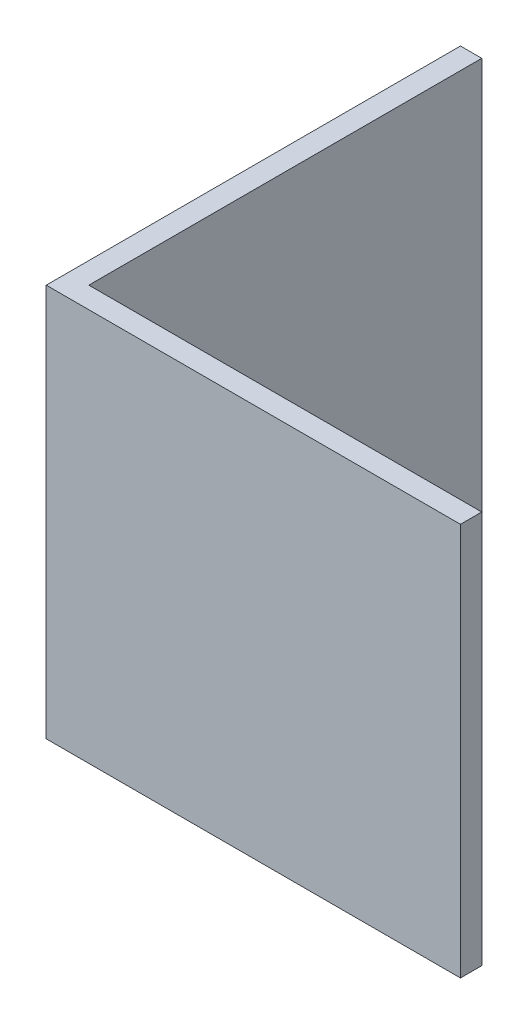
ISO-10303-21;
HEADER;
FILE_DESCRIPTION(('STEP AP214'),'2;1');
FILE_NAME('part.step','',(''),(''),'','','');
FILE_SCHEMA(('AUTOMOTIVE_DESIGN { 1 0 10303 214 1 1 1 1 }'));
ENDSEC;
DATA;
#1=APPLICATION_CONTEXT('core data for automotive mechanical design processes');
#2=APPLICATION_PROTOCOL_DEFINITION('international standard','automotive_design',2000,#1);
#3=PRODUCT_CONTEXT('',#1,'mechanical');
#4=PRODUCT('Part','Part','',(#3));
#5=PRODUCT_RELATED_PRODUCT_CATEGORY('part','',(#4));
#6=PRODUCT_DEFINITION_FORMATION('','',#4);
#7=PRODUCT_DEFINITION_CONTEXT('part definition',#1,'design');
#8=PRODUCT_DEFINITION('design','',#6,#7);
#9=PRODUCT_DEFINITION_SHAPE('','',#8);
#10=(LENGTH_UNIT() NAMED_UNIT(*) SI_UNIT(.MILLI.,.METRE.));
#11=(NAMED_UNIT(*) PLANE_ANGLE_UNIT() SI_UNIT($,.RADIAN.));
#12=(NAMED_UNIT(*) SI_UNIT($,.STERADIAN.) SOLID_ANGLE_UNIT());
#13=UNCERTAINTY_MEASURE_WITH_UNIT(LENGTH_MEASURE(1.E-05),#10,'distance_accuracy_value','');
#14=(GEOMETRIC_REPRESENTATION_CONTEXT(3) GLOBAL_UNCERTAINTY_ASSIGNED_CONTEXT((#13)) GLOBAL_UNIT_ASSIGNED_CONTEXT((#10,
#11,#12)) REPRESENTATION_CONTEXT('',''));
#15=CARTESIAN_POINT('',(0.,0.,0.));
#16=DIRECTION('',(0.,0.,1.));
#17=DIRECTION('',(1.,0.,0.));
#18=AXIS2_PLACEMENT_3D('',#15,#16,#17);
#19=CARTESIAN_POINT('',(-26.77668,50.8,26.77668));
#20=DIRECTION('',(1.,0.,0.));
#21=DIRECTION('',(0.,0.,-1.));
#22=AXIS2_PLACEMENT_3D('',#19,#20,#21);
#23=PLANE('',#22);
#24=DIRECTION('',(0.,0.,1.));
#25=VECTOR('',#24,1.);
#26=CARTESIAN_POINT('',(-26.77668,0.,26.77668));
#27=LINE('',#26,#25);
#28=CARTESIAN_POINT('',(-26.77668,0.,-26.77668));
#29=VERTEX_POINT('',#28);
#30=CARTESIAN_POINT('',(-26.77668,0.,26.77668));
#31=VERTEX_POINT('',#30);
#32=EDGE_CURVE('E132',#29,#31,#27,.T.);
#33=ORIENTED_EDGE('',*,*,#32,.T.);
#34=DIRECTION('',(0.,-1.,0.));
#35=VECTOR('',#34,1.);
#36=CARTESIAN_POINT('',(-26.77668,50.8,26.77668));
#37=LINE('',#36,#35);
#38=CARTESIAN_POINT('',(-26.77668,50.8,26.77668));
#39=VERTEX_POINT('',#38);
#40=EDGE_CURVE('E11',#39,#31,#37,.T.);
#41=ORIENTED_EDGE('',*,*,#40,.F.);
#42=DIRECTION('',(0.,0.,1.));
#43=VECTOR('',#42,1.);
#44=CARTESIAN_POINT('',(-26.77668,50.8,26.77668));
#45=LINE('',#44,#43);
#46=CARTESIAN_POINT('',(-26.77668,50.8,-26.77668));
#47=VERTEX_POINT('',#46);
#48=EDGE_CURVE('E148',#47,#39,#45,.T.);
#49=ORIENTED_EDGE('',*,*,#48,.F.);
#50=DIRECTION('',(0.,-1.,0.));
#51=VECTOR('',#50,1.);
#52=CARTESIAN_POINT('',(-26.77668,50.8,-26.77668));
#53=LINE('',#52,#51);
#54=EDGE_CURVE('E128',#47,#29,#53,.T.);
#55=ORIENTED_EDGE('',*,*,#54,.T.);
#56=EDGE_LOOP('',(#33,#41,#49,#55));
#57=FACE_BOUND('',#56,.T.);
#58=ADVANCED_FACE('F43',(#57),#23,.F.);
#59=CARTESIAN_POINT('',(-26.77668,50.8,26.77668));
#60=DIRECTION('',(0.,0.,-1.));
#61=DIRECTION('',(-1.,0.,0.));
#62=AXIS2_PLACEMENT_3D('',#59,#60,#61);
#63=PLANE('',#62);
#64=DIRECTION('',(1.,0.,0.));
#65=VECTOR('',#64,1.);
#66=CARTESIAN_POINT('',(-26.77668,0.,26.77668));
#67=LINE('',#66,#65);
#68=CARTESIAN_POINT('',(26.77668,0.,26.77668));
#69=VERTEX_POINT('',#68);
#70=EDGE_CURVE('E136',#31,#69,#67,.T.);
#71=ORIENTED_EDGE('',*,*,#70,.T.);
#72=DIRECTION('',(0.,-1.,0.));
#73=VECTOR('',#72,1.);
#74=CARTESIAN_POINT('',(26.77668,50.8,26.77668));
#75=LINE('',#74,#73);
#76=CARTESIAN_POINT('',(26.77668,50.8,26.77668));
#77=VERTEX_POINT('',#76);
#78=EDGE_CURVE('E52',#77,#69,#75,.T.);
#79=ORIENTED_EDGE('',*,*,#78,.F.);
#80=DIRECTION('',(1.,0.,0.));
#81=VECTOR('',#80,1.);
#82=CARTESIAN_POINT('',(-26.77668,50.8,26.77668));
#83=LINE('',#82,#81);
#84=EDGE_CURVE('E97',#39,#77,#83,.T.);
#85=ORIENTED_EDGE('',*,*,#84,.F.);
#86=ORIENTED_EDGE('',*,*,#40,.T.);
#87=EDGE_LOOP('',(#71,#79,#85,#86));
#88=FACE_BOUND('',#87,.T.);
#89=ADVANCED_FACE('F176',(#88),#63,.F.);
#90=CARTESIAN_POINT('',(26.77668,50.8,26.77668));
#91=DIRECTION('',(-1.,0.,0.));
#92=DIRECTION('',(0.,0.,1.));
#93=AXIS2_PLACEMENT_3D('',#90,#91,#92);
#94=PLANE('',#93);
#95=DIRECTION('',(0.,0.,-1.));
#96=VECTOR('',#95,1.);
#97=CARTESIAN_POINT('',(26.77668,0.,26.77668));
#98=LINE('',#97,#96);
#99=CARTESIAN_POINT('',(26.77668,0.,24.02332));
#100=VERTEX_POINT('',#99);
#101=EDGE_CURVE('E139',#69,#100,#98,.T.);
#102=ORIENTED_EDGE('',*,*,#101,.T.);
#103=DIRECTION('',(0.,-1.,0.));
#104=VECTOR('',#103,1.);
#105=CARTESIAN_POINT('',(26.77668,50.8,24.02332));
#106=LINE('',#105,#104);
#107=CARTESIAN_POINT('',(26.77668,50.8,24.02332));
#108=VERTEX_POINT('',#107);
#109=EDGE_CURVE('E121',#108,#100,#106,.T.);
#110=ORIENTED_EDGE('',*,*,#109,.F.);
#111=DIRECTION('',(0.,0.,-1.));
#112=VECTOR('',#111,1.);
#113=CARTESIAN_POINT('',(26.77668,50.8,26.77668));
#114=LINE('',#113,#112);
#115=EDGE_CURVE('E110',#77,#108,#114,.T.);
#116=ORIENTED_EDGE('',*,*,#115,.F.);
#117=ORIENTED_EDGE('',*,*,#78,.T.);
#118=EDGE_LOOP('',(#102,#110,#116,#117));
#119=FACE_BOUND('',#118,.T.);
#120=ADVANCED_FACE('F158',(#119),#94,.F.);
#121=CARTESIAN_POINT('',(26.77668,50.8,24.02332));
#122=DIRECTION('',(0.,0.,1.));
#123=DIRECTION('',(1.,0.,0.));
#124=AXIS2_PLACEMENT_3D('',#121,#122,#123);
#125=PLANE('',#124);
#126=DIRECTION('',(-1.,0.,0.));
#127=VECTOR('',#126,1.);
#128=CARTESIAN_POINT('',(26.77668,0.,24.02332));
#129=LINE('',#128,#127);
#130=CARTESIAN_POINT('',(-24.02332,0.,24.02332));
#131=VERTEX_POINT('',#130);
#132=EDGE_CURVE('E119',#100,#131,#129,.T.);
#133=ORIENTED_EDGE('',*,*,#132,.T.);
#134=DIRECTION('',(0.,-1.,0.));
#135=VECTOR('',#134,1.);
#136=CARTESIAN_POINT('',(-24.02332,50.8,24.02332));
#137=LINE('',#136,#135);
#138=CARTESIAN_POINT('',(-24.02332,50.8,24.02332));
#139=VERTEX_POINT('',#138);
#140=EDGE_CURVE('E116',#139,#131,#137,.T.);
#141=ORIENTED_EDGE('',*,*,#140,.F.);
#142=DIRECTION('',(-1.,0.,0.));
#143=VECTOR('',#142,1.);
#144=CARTESIAN_POINT('',(26.77668,50.8,24.02332));
#145=LINE('',#144,#143);
#146=EDGE_CURVE('E104',#108,#139,#145,.T.);
#147=ORIENTED_EDGE('',*,*,#146,.F.);
#148=ORIENTED_EDGE('',*,*,#109,.T.);
#149=EDGE_LOOP('',(#133,#141,#147,#148));
#150=FACE_BOUND('',#149,.T.);
#151=ADVANCED_FACE('F117',(#150),#125,.F.);
#152=CARTESIAN_POINT('',(-24.02332,50.8,-26.77668));
#153=DIRECTION('',(-1.,0.,0.));
#154=DIRECTION('',(0.,0.,1.));
#155=AXIS2_PLACEMENT_3D('',#152,#153,#154);
#156=PLANE('',#155);
#157=DIRECTION('',(0.,0.,-1.));
#158=VECTOR('',#157,1.);
#159=CARTESIAN_POINT('',(-24.02332,0.,-26.77668));
#160=LINE('',#159,#158);
#161=CARTESIAN_POINT('',(-24.02332,0.,-26.77668));
#162=VERTEX_POINT('',#161);
#163=EDGE_CURVE('E83',#131,#162,#160,.T.);
#164=ORIENTED_EDGE('',*,*,#163,.T.);
#165=DIRECTION('',(0.,-1.,0.));
#166=VECTOR('',#165,1.);
#167=CARTESIAN_POINT('',(-24.02332,50.8,-26.77668));
#168=LINE('',#167,#166);
#169=CARTESIAN_POINT('',(-24.02332,50.8,-26.77668));
#170=VERTEX_POINT('',#169);
#171=EDGE_CURVE('E122',#170,#162,#168,.T.);
#172=ORIENTED_EDGE('',*,*,#171,.F.);
#173=DIRECTION('',(0.,0.,-1.));
#174=VECTOR('',#173,1.);
#175=CARTESIAN_POINT('',(-24.02332,50.8,-26.77668));
#176=LINE('',#175,#174);
#177=EDGE_CURVE('E108',#139,#170,#176,.T.);
#178=ORIENTED_EDGE('',*,*,#177,.F.);
#179=ORIENTED_EDGE('',*,*,#140,.T.);
#180=EDGE_LOOP('',(#164,#172,#178,#179));
#181=FACE_BOUND('',#180,.T.);
#182=ADVANCED_FACE('F124',(#181),#156,.F.);
#183=CARTESIAN_POINT('',(-26.77668,50.8,-26.77668));
#184=DIRECTION('',(0.,0.,1.));
#185=DIRECTION('',(1.,0.,0.));
#186=AXIS2_PLACEMENT_3D('',#183,#184,#185);
#187=PLANE('',#186);
#188=DIRECTION('',(-1.,0.,0.));
#189=VECTOR('',#188,1.);
#190=CARTESIAN_POINT('',(-26.77668,0.,-26.77668));
#191=LINE('',#190,#189);
#192=EDGE_CURVE('E89',#162,#29,#191,.T.);
#193=ORIENTED_EDGE('',*,*,#192,.T.);
#194=ORIENTED_EDGE('',*,*,#54,.F.);
#195=DIRECTION('',(-1.,0.,0.));
#196=VECTOR('',#195,1.);
#197=CARTESIAN_POINT('',(-26.77668,50.8,-26.77668));
#198=LINE('',#197,#196);
#199=EDGE_CURVE('E60',#170,#47,#198,.T.);
#200=ORIENTED_EDGE('',*,*,#199,.F.);
#201=ORIENTED_EDGE('',*,*,#171,.T.);
#202=EDGE_LOOP('',(#193,#194,#200,#201));
#203=FACE_BOUND('',#202,.T.);
#204=ADVANCED_FACE('F165',(#203),#187,.F.);
#205=CARTESIAN_POINT('',(0.,50.8,0.));
#206=DIRECTION('',(0.,-1.,0.));
#207=DIRECTION('',(0.,0.,-1.));
#208=AXIS2_PLACEMENT_3D('',#205,#206,#207);
#209=PLANE('',#208);
#210=ORIENTED_EDGE('',*,*,#48,.T.);
#211=ORIENTED_EDGE('',*,*,#84,.T.);
#212=ORIENTED_EDGE('',*,*,#115,.T.);
#213=ORIENTED_EDGE('',*,*,#146,.T.);
#214=ORIENTED_EDGE('',*,*,#177,.T.);
#215=ORIENTED_EDGE('',*,*,#199,.T.);
#216=EDGE_LOOP('',(#210,#211,#212,#213,#214,#215));
#217=FACE_BOUND('',#216,.T.);
#218=ADVANCED_FACE('F106',(#217),#209,.F.);
#219=CARTESIAN_POINT('',(0.,0.,0.));
#220=DIRECTION('',(0.,-1.,0.));
#221=DIRECTION('',(0.,0.,-1.));
#222=AXIS2_PLACEMENT_3D('',#219,#220,#221);
#223=PLANE('',#222);
#224=ORIENTED_EDGE('',*,*,#32,.F.);
#225=ORIENTED_EDGE('',*,*,#192,.F.);
#226=ORIENTED_EDGE('',*,*,#163,.F.);
#227=ORIENTED_EDGE('',*,*,#132,.F.);
#228=ORIENTED_EDGE('',*,*,#101,.F.);
#229=ORIENTED_EDGE('',*,*,#70,.F.);
#230=EDGE_LOOP('',(#224,#225,#226,#227,#228,#229));
#231=FACE_BOUND('',#230,.T.);
#232=ADVANCED_FACE('F161',(#231),#223,.T.);
#233=CLOSED_SHELL('',(#58,#89,#120,#151,#182,#204,#218,#232));
#234=MANIFOLD_SOLID_BREP('B2',#233);
#235=ADVANCED_BREP_SHAPE_REPRESENTATION('',(#18,#234),#14);
#236=SHAPE_DEFINITION_REPRESENTATION(#9,#235);
ENDSEC;
END-ISO-10303-21;
